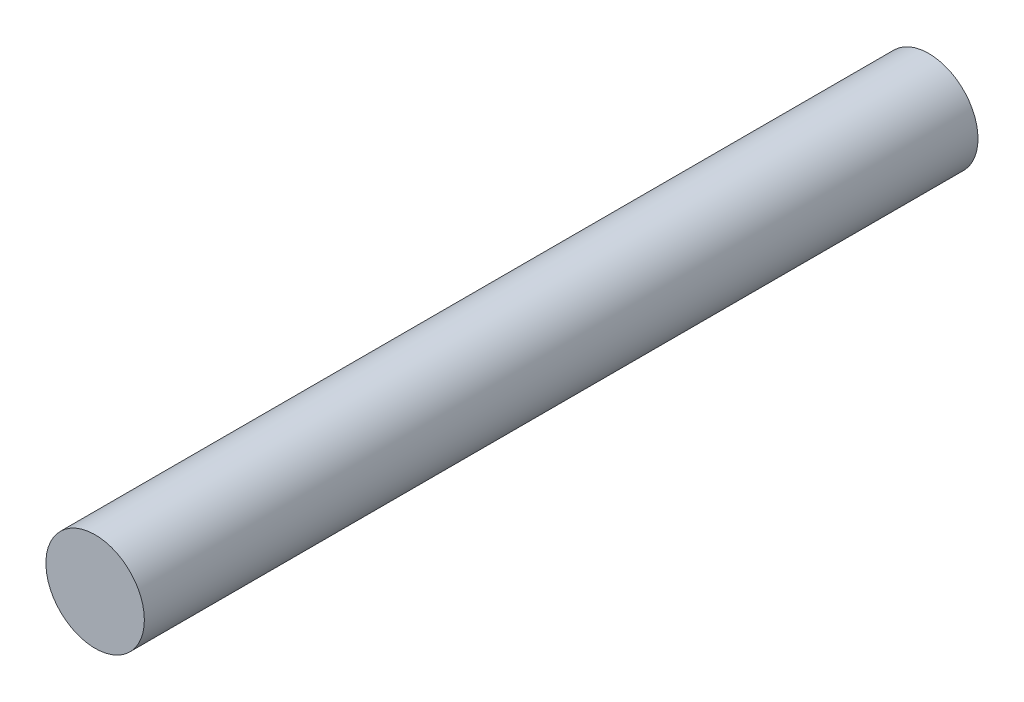
ISO-10303-21;
HEADER;
FILE_DESCRIPTION(('STEP AP214'),'2;1');
FILE_NAME('part.step','',(''),(''),'','','');
FILE_SCHEMA(('AUTOMOTIVE_DESIGN { 1 0 10303 214 1 1 1 1 }'));
ENDSEC;
DATA;
#1=APPLICATION_CONTEXT('core data for automotive mechanical design processes');
#2=APPLICATION_PROTOCOL_DEFINITION('international standard','automotive_design',2000,#1);
#3=PRODUCT_CONTEXT('',#1,'mechanical');
#4=PRODUCT('Part','Part','',(#3));
#5=PRODUCT_RELATED_PRODUCT_CATEGORY('part','',(#4));
#6=PRODUCT_DEFINITION_FORMATION('','',#4);
#7=PRODUCT_DEFINITION_CONTEXT('part definition',#1,'design');
#8=PRODUCT_DEFINITION('design','',#6,#7);
#9=PRODUCT_DEFINITION_SHAPE('','',#8);
#10=(LENGTH_UNIT() NAMED_UNIT(*) SI_UNIT(.MILLI.,.METRE.));
#11=(NAMED_UNIT(*) PLANE_ANGLE_UNIT() SI_UNIT($,.RADIAN.));
#12=(NAMED_UNIT(*) SI_UNIT($,.STERADIAN.) SOLID_ANGLE_UNIT());
#13=UNCERTAINTY_MEASURE_WITH_UNIT(LENGTH_MEASURE(1.E-05),#10,'distance_accuracy_value','');
#14=(GEOMETRIC_REPRESENTATION_CONTEXT(3) GLOBAL_UNCERTAINTY_ASSIGNED_CONTEXT((#13)) GLOBAL_UNIT_ASSIGNED_CONTEXT((#10,
#11,#12)) REPRESENTATION_CONTEXT('',''));
#15=CARTESIAN_POINT('',(0.,0.,0.));
#16=DIRECTION('',(0.,0.,1.));
#17=DIRECTION('',(1.,0.,0.));
#18=AXIS2_PLACEMENT_3D('',#15,#16,#17);
#19=CARTESIAN_POINT('',(-18.1527790152953,-99.4140414395688,-33.02));
#20=DIRECTION('',(0.,0.,1.));
#21=DIRECTION('',(1.,0.,0.));
#22=AXIS2_PLACEMENT_3D('',#19,#20,#21);
#23=CYLINDRICAL_SURFACE('',#22,1.95);
#24=CARTESIAN_POINT('',(-18.1527790152953,-99.4140414395688,-33.02));
#25=DIRECTION('',(0.,0.,1.));
#26=DIRECTION('',(1.,0.,0.));
#27=AXIS2_PLACEMENT_3D('',#24,#25,#26);
#28=CIRCLE('',#27,1.95);
#29=CARTESIAN_POINT('',(-16.2027790152953,-99.4140414395688,-33.02));
#30=VERTEX_POINT('',#29);
#31=EDGE_CURVE('E10',#30,#30,#28,.T.);
#32=ORIENTED_EDGE('',*,*,#31,.T.);
#33=EDGE_LOOP('',(#32));
#34=FACE_BOUND('',#33,.T.);
#35=CARTESIAN_POINT('',(-18.1527790152953,-99.4140414395688,0.));
#36=DIRECTION('',(0.,0.,1.));
#37=DIRECTION('',(1.,0.,0.));
#38=AXIS2_PLACEMENT_3D('',#35,#36,#37);
#39=CIRCLE('',#38,1.95);
#40=CARTESIAN_POINT('',(-16.2027790152953,-99.4140414395688,0.));
#41=VERTEX_POINT('',#40);
#42=EDGE_CURVE('E35',#41,#41,#39,.T.);
#43=ORIENTED_EDGE('',*,*,#42,.F.);
#44=EDGE_LOOP('',(#43));
#45=FACE_BOUND('',#44,.T.);
#46=ADVANCED_FACE('F32',(#34,#45),#23,.T.);
#47=CARTESIAN_POINT('',(-18.1527790152953,-99.4140414395688,-33.02));
#48=DIRECTION('',(0.,0.,1.));
#49=DIRECTION('',(1.,0.,0.));
#50=AXIS2_PLACEMENT_3D('',#47,#48,#49);
#51=PLANE('',#50);
#52=ORIENTED_EDGE('',*,*,#31,.F.);
#53=EDGE_LOOP('',(#52));
#54=FACE_BOUND('',#53,.T.);
#55=ADVANCED_FACE('F47',(#54),#51,.F.);
#56=CARTESIAN_POINT('',(-18.1527790152953,-99.4140414395688,0.));
#57=DIRECTION('',(0.,0.,1.));
#58=DIRECTION('',(1.,0.,0.));
#59=AXIS2_PLACEMENT_3D('',#56,#57,#58);
#60=PLANE('',#59);
#61=ORIENTED_EDGE('',*,*,#42,.T.);
#62=EDGE_LOOP('',(#61));
#63=FACE_BOUND('',#62,.T.);
#64=ADVANCED_FACE('F44',(#63),#60,.T.);
#65=CLOSED_SHELL('',(#46,#55,#64));
#66=MANIFOLD_SOLID_BREP('B2',#65);
#67=ADVANCED_BREP_SHAPE_REPRESENTATION('',(#18,#66),#14);
#68=SHAPE_DEFINITION_REPRESENTATION(#9,#67);
ENDSEC;
END-ISO-10303-21;
